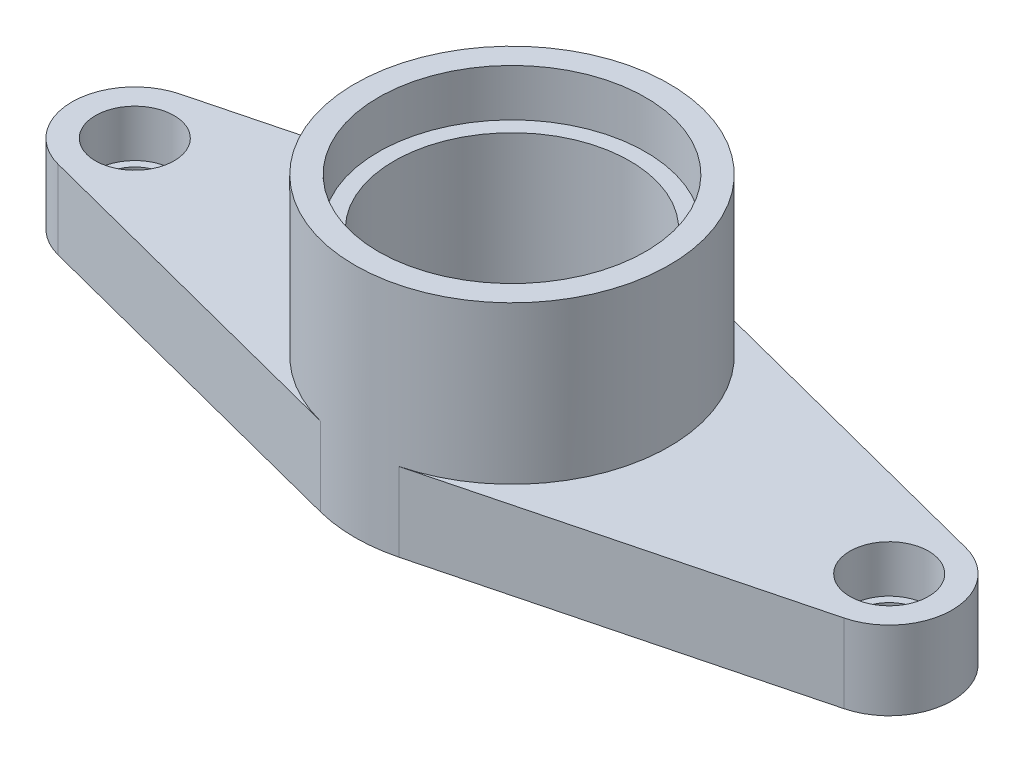
ISO-10303-21;
HEADER;
FILE_DESCRIPTION(('STEP AP214'),'2;1');
FILE_NAME('part.step','',(''),(''),'','','');
FILE_SCHEMA(('AUTOMOTIVE_DESIGN { 1 0 10303 214 1 1 1 1 }'));
ENDSEC;
DATA;
#1=APPLICATION_CONTEXT('core data for automotive mechanical design processes');
#2=APPLICATION_PROTOCOL_DEFINITION('international standard','automotive_design',2000,#1);
#3=PRODUCT_CONTEXT('',#1,'mechanical');
#4=PRODUCT('Part','Part','',(#3));
#5=PRODUCT_RELATED_PRODUCT_CATEGORY('part','',(#4));
#6=PRODUCT_DEFINITION_FORMATION('','',#4);
#7=PRODUCT_DEFINITION_CONTEXT('part definition',#1,'design');
#8=PRODUCT_DEFINITION('design','',#6,#7);
#9=PRODUCT_DEFINITION_SHAPE('','',#8);
#10=(LENGTH_UNIT() NAMED_UNIT(*) SI_UNIT(.MILLI.,.METRE.));
#11=(NAMED_UNIT(*) PLANE_ANGLE_UNIT() SI_UNIT($,.RADIAN.));
#12=(NAMED_UNIT(*) SI_UNIT($,.STERADIAN.) SOLID_ANGLE_UNIT());
#13=UNCERTAINTY_MEASURE_WITH_UNIT(LENGTH_MEASURE(1.E-05),#10,'distance_accuracy_value','');
#14=(GEOMETRIC_REPRESENTATION_CONTEXT(3) GLOBAL_UNCERTAINTY_ASSIGNED_CONTEXT((#13)) GLOBAL_UNIT_ASSIGNED_CONTEXT((#10,
#11,#12)) REPRESENTATION_CONTEXT('',''));
#15=CARTESIAN_POINT('',(0.,0.,0.));
#16=DIRECTION('',(0.,0.,1.));
#17=DIRECTION('',(1.,0.,0.));
#18=AXIS2_PLACEMENT_3D('',#15,#16,#17);
#19=CARTESIAN_POINT('',(-120.,25.,0.));
#20=DIRECTION('',(0.,1.,0.));
#21=DIRECTION('',(0.,0.,1.));
#22=AXIS2_PLACEMENT_3D('',#19,#20,#21);
#23=PLANE('',#22);
#24=CARTESIAN_POINT('',(-120.,25.,0.));
#25=DIRECTION('',(0.,1.,0.));
#26=DIRECTION('',(0.,0.,1.));
#27=AXIS2_PLACEMENT_3D('',#24,#25,#26);
#28=CIRCLE('',#27,12.5);
#29=CARTESIAN_POINT('',(-120.,25.,12.5));
#30=VERTEX_POINT('',#29);
#31=EDGE_CURVE('E158',#30,#30,#28,.T.);
#32=ORIENTED_EDGE('',*,*,#31,.F.);
#33=EDGE_LOOP('',(#32));
#34=FACE_BOUND('',#33,.T.);
#35=DIRECTION('',(0.968245836551854,0.,0.25));
#36=VECTOR('',#35,1.);
#37=CARTESIAN_POINT('',(-125.,25.,19.3649167310371));
#38=LINE('',#37,#36);
#39=CARTESIAN_POINT('',(-125.,25.,19.3649167310371));
#40=VERTEX_POINT('',#39);
#41=CARTESIAN_POINT('',(-12.5,25.,48.4122918275927));
#42=VERTEX_POINT('',#41);
#43=EDGE_CURVE('E99',#40,#42,#38,.T.);
#44=ORIENTED_EDGE('',*,*,#43,.T.);
#45=CARTESIAN_POINT('',(0.,25.,0.));
#46=DIRECTION('',(0.,1.,0.));
#47=DIRECTION('',(0.,0.,1.));
#48=AXIS2_PLACEMENT_3D('',#45,#46,#47);
#49=CIRCLE('',#48,50.);
#50=CARTESIAN_POINT('',(-12.5,25.,-48.4122918275927));
#51=VERTEX_POINT('',#50);
#52=EDGE_CURVE('E142',#42,#51,#49,.F.);
#53=ORIENTED_EDGE('',*,*,#52,.T.);
#54=DIRECTION('',(0.968245836551854,0.,-0.25));
#55=VECTOR('',#54,1.);
#56=CARTESIAN_POINT('',(-125.,25.,-19.3649167310371));
#57=LINE('',#56,#55);
#58=CARTESIAN_POINT('',(-125.,25.,-19.3649167310371));
#59=VERTEX_POINT('',#58);
#60=EDGE_CURVE('E124',#59,#51,#57,.T.);
#61=ORIENTED_EDGE('',*,*,#60,.F.);
#62=CARTESIAN_POINT('',(-120.,25.,0.));
#63=DIRECTION('',(0.,1.,0.));
#64=DIRECTION('',(0.,0.,1.));
#65=AXIS2_PLACEMENT_3D('',#62,#63,#64);
#66=CIRCLE('',#65,20.);
#67=EDGE_CURVE('E178',#59,#40,#66,.T.);
#68=ORIENTED_EDGE('',*,*,#67,.T.);
#69=EDGE_LOOP('',(#44,#53,#61,#68));
#70=FACE_BOUND('',#69,.T.);
#71=ADVANCED_FACE('F39',(#34,#70),#23,.T.);
#72=CARTESIAN_POINT('',(120.,25.,0.));
#73=DIRECTION('',(0.,1.,0.));
#74=DIRECTION('',(0.,0.,-1.));
#75=AXIS2_PLACEMENT_3D('',#72,#73,#74);
#76=CIRCLE('',#75,12.5);
#77=CARTESIAN_POINT('',(120.,25.,-12.5));
#78=VERTEX_POINT('',#77);
#79=EDGE_CURVE('E147',#78,#78,#76,.T.);
#80=ORIENTED_EDGE('',*,*,#79,.F.);
#81=EDGE_LOOP('',(#80));
#82=FACE_BOUND('',#81,.T.);
#83=DIRECTION('',(-0.968245836551854,0.,-0.25));
#84=VECTOR('',#83,1.);
#85=CARTESIAN_POINT('',(125.,25.,-19.3649167310371));
#86=LINE('',#85,#84);
#87=CARTESIAN_POINT('',(125.,25.,-19.3649167310371));
#88=VERTEX_POINT('',#87);
#89=CARTESIAN_POINT('',(12.5,25.,-48.4122918275927));
#90=VERTEX_POINT('',#89);
#91=EDGE_CURVE('E114',#88,#90,#86,.T.);
#92=ORIENTED_EDGE('',*,*,#91,.T.);
#93=CARTESIAN_POINT('',(12.5,25.,48.4122918275927));
#94=VERTEX_POINT('',#93);
#95=EDGE_CURVE('E119',#90,#94,#49,.F.);
#96=ORIENTED_EDGE('',*,*,#95,.T.);
#97=DIRECTION('',(-0.968245836551854,0.,0.25));
#98=VECTOR('',#97,1.);
#99=CARTESIAN_POINT('',(125.,25.,19.3649167310371));
#100=LINE('',#99,#98);
#101=CARTESIAN_POINT('',(125.,25.,19.3649167310371));
#102=VERTEX_POINT('',#101);
#103=EDGE_CURVE('E184',#102,#94,#100,.T.);
#104=ORIENTED_EDGE('',*,*,#103,.F.);
#105=CARTESIAN_POINT('',(120.,25.,0.));
#106=DIRECTION('',(0.,-1.,0.));
#107=DIRECTION('',(0.,0.,-1.));
#108=AXIS2_PLACEMENT_3D('',#105,#106,#107);
#109=CIRCLE('',#108,20.);
#110=EDGE_CURVE('E121',#88,#102,#109,.T.);
#111=ORIENTED_EDGE('',*,*,#110,.F.);
#112=EDGE_LOOP('',(#92,#96,#104,#111));
#113=FACE_BOUND('',#112,.T.);
#114=ADVANCED_FACE('F116',(#82,#113),#23,.T.);
#115=CARTESIAN_POINT('',(-120.,0.,0.));
#116=DIRECTION('',(0.,1.,0.));
#117=DIRECTION('',(0.,0.,1.));
#118=AXIS2_PLACEMENT_3D('',#115,#116,#117);
#119=CYLINDRICAL_SURFACE('',#118,9.99999999999999);
#120=CARTESIAN_POINT('',(-120.,0.,0.));
#121=DIRECTION('',(0.,1.,0.));
#122=DIRECTION('',(0.,0.,1.));
#123=AXIS2_PLACEMENT_3D('',#120,#121,#122);
#124=CIRCLE('',#123,9.99999999999999);
#125=CARTESIAN_POINT('',(-120.,0.,9.99999999999999));
#126=VERTEX_POINT('',#125);
#127=EDGE_CURVE('E169',#126,#126,#124,.T.);
#128=ORIENTED_EDGE('',*,*,#127,.F.);
#129=EDGE_LOOP('',(#128));
#130=FACE_BOUND('',#129,.T.);
#131=CARTESIAN_POINT('',(-120.,10.,0.));
#132=DIRECTION('',(0.,1.,0.));
#133=DIRECTION('',(0.,0.,1.));
#134=AXIS2_PLACEMENT_3D('',#131,#132,#133);
#135=CIRCLE('',#134,9.99999999999999);
#136=CARTESIAN_POINT('',(-120.,10.,9.99999999999999));
#137=VERTEX_POINT('',#136);
#138=EDGE_CURVE('E157',#137,#137,#135,.F.);
#139=ORIENTED_EDGE('',*,*,#138,.F.);
#140=EDGE_LOOP('',(#139));
#141=FACE_BOUND('',#140,.T.);
#142=ADVANCED_FACE('F262',(#130,#141),#119,.F.);
#143=CARTESIAN_POINT('',(-120.,25.,0.));
#144=DIRECTION('',(0.,-1.,0.));
#145=DIRECTION('',(0.,0.,-1.));
#146=AXIS2_PLACEMENT_3D('',#143,#144,#145);
#147=CYLINDRICAL_SURFACE('',#146,20.);
#148=CARTESIAN_POINT('',(-120.,0.,0.));
#149=DIRECTION('',(0.,1.,0.));
#150=DIRECTION('',(0.,0.,1.));
#151=AXIS2_PLACEMENT_3D('',#148,#149,#150);
#152=CIRCLE('',#151,20.);
#153=CARTESIAN_POINT('',(-125.,0.,-19.3649167310371));
#154=VERTEX_POINT('',#153);
#155=CARTESIAN_POINT('',(-125.,0.,19.3649167310371));
#156=VERTEX_POINT('',#155);
#157=EDGE_CURVE('E173',#154,#156,#152,.T.);
#158=ORIENTED_EDGE('',*,*,#157,.T.);
#159=DIRECTION('',(0.,-1.,0.));
#160=VECTOR('',#159,1.);
#161=CARTESIAN_POINT('',(-125.,25.,19.3649167310371));
#162=LINE('',#161,#160);
#163=EDGE_CURVE('E11',#40,#156,#162,.T.);
#164=ORIENTED_EDGE('',*,*,#163,.F.);
#165=ORIENTED_EDGE('',*,*,#67,.F.);
#166=DIRECTION('',(0.,-1.,0.));
#167=VECTOR('',#166,1.);
#168=CARTESIAN_POINT('',(-125.,25.,-19.3649167310371));
#169=LINE('',#168,#167);
#170=EDGE_CURVE('E59',#59,#154,#169,.T.);
#171=ORIENTED_EDGE('',*,*,#170,.T.);
#172=EDGE_LOOP('',(#158,#164,#165,#171));
#173=FACE_BOUND('',#172,.T.);
#174=ADVANCED_FACE('F41',(#173),#147,.T.);
#175=CARTESIAN_POINT('',(-125.,25.,19.3649167310371));
#176=DIRECTION('',(0.25,0.,-0.968245836551854));
#177=DIRECTION('',(-0.968245836551854,0.,-0.25));
#178=AXIS2_PLACEMENT_3D('',#175,#176,#177);
#179=PLANE('',#178);
#180=DIRECTION('',(0.968245836551854,0.,0.25));
#181=VECTOR('',#180,1.);
#182=CARTESIAN_POINT('',(-125.,0.,19.3649167310371));
#183=LINE('',#182,#181);
#184=CARTESIAN_POINT('',(-12.5,0.,48.4122918275927));
#185=VERTEX_POINT('',#184);
#186=EDGE_CURVE('E194',#156,#185,#183,.T.);
#187=ORIENTED_EDGE('',*,*,#186,.T.);
#188=DIRECTION('',(0.,-1.,0.));
#189=VECTOR('',#188,1.);
#190=CARTESIAN_POINT('',(-12.5,25.,48.4122918275927));
#191=LINE('',#190,#189);
#192=EDGE_CURVE('E50',#42,#185,#191,.T.);
#193=ORIENTED_EDGE('',*,*,#192,.F.);
#194=ORIENTED_EDGE('',*,*,#43,.F.);
#195=ORIENTED_EDGE('',*,*,#163,.T.);
#196=EDGE_LOOP('',(#187,#193,#194,#195));
#197=FACE_BOUND('',#196,.T.);
#198=ADVANCED_FACE('F286',(#197),#179,.F.);
#199=CARTESIAN_POINT('',(125.,25.,19.3649167310371));
#200=DIRECTION('',(0.25,0.,0.968245836551854));
#201=DIRECTION('',(0.968245836551854,0.,-0.25));
#202=AXIS2_PLACEMENT_3D('',#199,#200,#201);
#203=PLANE('',#202);
#204=DIRECTION('',(-0.968245836551854,0.,0.25));
#205=VECTOR('',#204,1.);
#206=CARTESIAN_POINT('',(125.,0.,19.3649167310371));
#207=LINE('',#206,#205);
#208=CARTESIAN_POINT('',(125.,0.,19.3649167310371));
#209=VERTEX_POINT('',#208);
#210=CARTESIAN_POINT('',(12.5,0.,48.4122918275927));
#211=VERTEX_POINT('',#210);
#212=EDGE_CURVE('E200',#209,#211,#207,.T.);
#213=ORIENTED_EDGE('',*,*,#212,.F.);
#214=DIRECTION('',(0.,-1.,0.));
#215=VECTOR('',#214,1.);
#216=CARTESIAN_POINT('',(125.,25.,19.3649167310371));
#217=LINE('',#216,#215);
#218=EDGE_CURVE('E222',#102,#209,#217,.T.);
#219=ORIENTED_EDGE('',*,*,#218,.F.);
#220=ORIENTED_EDGE('',*,*,#103,.T.);
#221=DIRECTION('',(0.,-1.,0.));
#222=VECTOR('',#221,1.);
#223=CARTESIAN_POINT('',(12.5,25.,48.4122918275927));
#224=LINE('',#223,#222);
#225=EDGE_CURVE('E140',#94,#211,#224,.T.);
#226=ORIENTED_EDGE('',*,*,#225,.T.);
#227=EDGE_LOOP('',(#213,#219,#220,#226));
#228=FACE_BOUND('',#227,.T.);
#229=ADVANCED_FACE('F283',(#228),#203,.T.);
#230=CARTESIAN_POINT('',(120.,25.,0.));
#231=DIRECTION('',(0.,-1.,0.));
#232=DIRECTION('',(0.,0.,-1.));
#233=AXIS2_PLACEMENT_3D('',#230,#231,#232);
#234=CYLINDRICAL_SURFACE('',#233,20.);
#235=CARTESIAN_POINT('',(120.,0.,0.));
#236=DIRECTION('',(0.,-1.,0.));
#237=DIRECTION('',(0.,0.,-1.));
#238=AXIS2_PLACEMENT_3D('',#235,#236,#237);
#239=CIRCLE('',#238,20.);
#240=CARTESIAN_POINT('',(125.,0.,-19.3649167310371));
#241=VERTEX_POINT('',#240);
#242=EDGE_CURVE('E204',#241,#209,#239,.T.);
#243=ORIENTED_EDGE('',*,*,#242,.F.);
#244=DIRECTION('',(0.,-1.,0.));
#245=VECTOR('',#244,1.);
#246=CARTESIAN_POINT('',(125.,25.,-19.3649167310371));
#247=LINE('',#246,#245);
#248=EDGE_CURVE('E134',#88,#241,#247,.T.);
#249=ORIENTED_EDGE('',*,*,#248,.F.);
#250=ORIENTED_EDGE('',*,*,#110,.T.);
#251=ORIENTED_EDGE('',*,*,#218,.T.);
#252=EDGE_LOOP('',(#243,#249,#250,#251));
#253=FACE_BOUND('',#252,.T.);
#254=ADVANCED_FACE('F280',(#253),#234,.T.);
#255=CARTESIAN_POINT('',(125.,25.,-19.3649167310371));
#256=DIRECTION('',(-0.25,0.,0.968245836551854));
#257=DIRECTION('',(0.968245836551854,0.,0.25));
#258=AXIS2_PLACEMENT_3D('',#255,#256,#257);
#259=PLANE('',#258);
#260=DIRECTION('',(-0.968245836551854,0.,-0.25));
#261=VECTOR('',#260,1.);
#262=CARTESIAN_POINT('',(125.,0.,-19.3649167310371));
#263=LINE('',#262,#261);
#264=CARTESIAN_POINT('',(12.5,0.,-48.4122918275927));
#265=VERTEX_POINT('',#264);
#266=EDGE_CURVE('E130',#241,#265,#263,.T.);
#267=ORIENTED_EDGE('',*,*,#266,.T.);
#268=DIRECTION('',(0.,-1.,0.));
#269=VECTOR('',#268,1.);
#270=CARTESIAN_POINT('',(12.5,25.,-48.4122918275927));
#271=LINE('',#270,#269);
#272=EDGE_CURVE('E127',#90,#265,#271,.T.);
#273=ORIENTED_EDGE('',*,*,#272,.F.);
#274=ORIENTED_EDGE('',*,*,#91,.F.);
#275=ORIENTED_EDGE('',*,*,#248,.T.);
#276=EDGE_LOOP('',(#267,#273,#274,#275));
#277=FACE_BOUND('',#276,.T.);
#278=ADVANCED_FACE('F128',(#277),#259,.F.);
#279=CARTESIAN_POINT('',(0.,25.,0.));
#280=DIRECTION('',(0.,-1.,0.));
#281=DIRECTION('',(0.,0.,-1.));
#282=AXIS2_PLACEMENT_3D('',#279,#280,#281);
#283=CYLINDRICAL_SURFACE('',#282,50.);
#284=CARTESIAN_POINT('',(0.,0.,0.));
#285=DIRECTION('',(0.,1.,0.));
#286=DIRECTION('',(0.,0.,1.));
#287=AXIS2_PLACEMENT_3D('',#284,#285,#286);
#288=CIRCLE('',#287,50.);
#289=CARTESIAN_POINT('',(-12.5,0.,-48.4122918275927));
#290=VERTEX_POINT('',#289);
#291=EDGE_CURVE('E210',#265,#290,#288,.T.);
#292=ORIENTED_EDGE('',*,*,#291,.T.);
#293=DIRECTION('',(0.,-1.,0.));
#294=VECTOR('',#293,1.);
#295=CARTESIAN_POINT('',(-12.5,25.,-48.4122918275927));
#296=LINE('',#295,#294);
#297=EDGE_CURVE('E87',#51,#290,#296,.T.);
#298=ORIENTED_EDGE('',*,*,#297,.F.);
#299=ORIENTED_EDGE('',*,*,#52,.F.);
#300=ORIENTED_EDGE('',*,*,#192,.T.);
#301=CARTESIAN_POINT('',(0.,0.,0.));
#302=DIRECTION('',(0.,1.,0.));
#303=DIRECTION('',(0.,0.,1.));
#304=AXIS2_PLACEMENT_3D('',#301,#302,#303);
#305=CIRCLE('',#304,50.);
#306=EDGE_CURVE('E197',#185,#211,#305,.T.);
#307=ORIENTED_EDGE('',*,*,#306,.T.);
#308=ORIENTED_EDGE('',*,*,#225,.F.);
#309=ORIENTED_EDGE('',*,*,#95,.F.);
#310=ORIENTED_EDGE('',*,*,#272,.T.);
#311=EDGE_LOOP('',(#292,#298,#299,#300,#307,#308,#309,#310));
#312=FACE_BOUND('',#311,.T.);
#313=CARTESIAN_POINT('',(0.,75.,0.));
#314=DIRECTION('',(0.,1.,0.));
#315=DIRECTION('',(0.,0.,1.));
#316=AXIS2_PLACEMENT_3D('',#313,#314,#315);
#317=CIRCLE('',#316,50.);
#318=CARTESIAN_POINT('',(0.,75.,50.));
#319=VERTEX_POINT('',#318);
#320=EDGE_CURVE('E143',#319,#319,#317,.T.);
#321=ORIENTED_EDGE('',*,*,#320,.F.);
#322=EDGE_LOOP('',(#321));
#323=FACE_BOUND('',#322,.T.);
#324=ADVANCED_FACE('F137',(#312,#323),#283,.T.);
#325=CARTESIAN_POINT('',(-125.,25.,-19.3649167310371));
#326=DIRECTION('',(-0.25,0.,-0.968245836551854));
#327=DIRECTION('',(-0.968245836551854,0.,0.25));
#328=AXIS2_PLACEMENT_3D('',#325,#326,#327);
#329=PLANE('',#328);
#330=DIRECTION('',(0.968245836551854,0.,-0.25));
#331=VECTOR('',#330,1.);
#332=CARTESIAN_POINT('',(-125.,0.,-19.3649167310371));
#333=LINE('',#332,#331);
#334=EDGE_CURVE('E181',#154,#290,#333,.T.);
#335=ORIENTED_EDGE('',*,*,#334,.F.);
#336=ORIENTED_EDGE('',*,*,#170,.F.);
#337=ORIENTED_EDGE('',*,*,#60,.T.);
#338=ORIENTED_EDGE('',*,*,#297,.T.);
#339=EDGE_LOOP('',(#335,#336,#337,#338));
#340=FACE_BOUND('',#339,.T.);
#341=ADVANCED_FACE('F272',(#340),#329,.T.);
#342=CARTESIAN_POINT('',(-120.,0.,0.));
#343=DIRECTION('',(0.,1.,0.));
#344=DIRECTION('',(0.,0.,1.));
#345=AXIS2_PLACEMENT_3D('',#342,#343,#344);
#346=PLANE('',#345);
#347=CARTESIAN_POINT('',(0.,0.,0.));
#348=DIRECTION('',(0.,1.,0.));
#349=DIRECTION('',(0.,0.,1.));
#350=AXIS2_PLACEMENT_3D('',#347,#348,#349);
#351=CIRCLE('',#350,37.5);
#352=CARTESIAN_POINT('',(0.,0.,37.5));
#353=VERTEX_POINT('',#352);
#354=EDGE_CURVE('E436',#353,#353,#351,.T.);
#355=ORIENTED_EDGE('',*,*,#354,.T.);
#356=EDGE_LOOP('',(#355));
#357=FACE_BOUND('',#356,.T.);
#358=ORIENTED_EDGE('',*,*,#306,.F.);
#359=ORIENTED_EDGE('',*,*,#186,.F.);
#360=ORIENTED_EDGE('',*,*,#157,.F.);
#361=ORIENTED_EDGE('',*,*,#334,.T.);
#362=ORIENTED_EDGE('',*,*,#291,.F.);
#363=ORIENTED_EDGE('',*,*,#266,.F.);
#364=ORIENTED_EDGE('',*,*,#242,.T.);
#365=ORIENTED_EDGE('',*,*,#212,.T.);
#366=EDGE_LOOP('',(#358,#359,#360,#361,#362,#363,#364,#365));
#367=FACE_BOUND('',#366,.T.);
#368=CARTESIAN_POINT('',(120.,0.,0.));
#369=DIRECTION('',(0.,1.,0.));
#370=DIRECTION('',(0.,0.,-1.));
#371=AXIS2_PLACEMENT_3D('',#368,#369,#370);
#372=CIRCLE('',#371,9.99999999999999);
#373=CARTESIAN_POINT('',(120.,0.,-9.99999999999999));
#374=VERTEX_POINT('',#373);
#375=EDGE_CURVE('E174',#374,#374,#372,.T.);
#376=ORIENTED_EDGE('',*,*,#375,.T.);
#377=EDGE_LOOP('',(#376));
#378=FACE_BOUND('',#377,.T.);
#379=ORIENTED_EDGE('',*,*,#127,.T.);
#380=EDGE_LOOP('',(#379));
#381=FACE_BOUND('',#380,.T.);
#382=ADVANCED_FACE('F269',(#357,#367,#378,#381),#346,.F.);
#383=CARTESIAN_POINT('',(120.,0.,0.));
#384=DIRECTION('',(0.,1.,0.));
#385=DIRECTION('',(0.,0.,1.));
#386=AXIS2_PLACEMENT_3D('',#383,#384,#385);
#387=CYLINDRICAL_SURFACE('',#386,9.99999999999999);
#388=CARTESIAN_POINT('',(120.,10.,0.));
#389=DIRECTION('',(0.,-1.,0.));
#390=DIRECTION('',(0.,0.,-1.));
#391=AXIS2_PLACEMENT_3D('',#388,#389,#390);
#392=CIRCLE('',#391,9.99999999999999);
#393=CARTESIAN_POINT('',(120.,10.,-9.99999999999999));
#394=VERTEX_POINT('',#393);
#395=EDGE_CURVE('E43',#394,#394,#392,.F.);
#396=ORIENTED_EDGE('',*,*,#395,.T.);
#397=EDGE_LOOP('',(#396));
#398=FACE_BOUND('',#397,.T.);
#399=ORIENTED_EDGE('',*,*,#375,.F.);
#400=EDGE_LOOP('',(#399));
#401=FACE_BOUND('',#400,.T.);
#402=ADVANCED_FACE('F237',(#398,#401),#387,.F.);
#403=CARTESIAN_POINT('',(-120.,10.,0.));
#404=DIRECTION('',(0.,1.,0.));
#405=DIRECTION('',(0.,0.,1.));
#406=AXIS2_PLACEMENT_3D('',#403,#404,#405);
#407=PLANE('',#406);
#408=CARTESIAN_POINT('',(-120.,10.,0.));
#409=DIRECTION('',(0.,1.,0.));
#410=DIRECTION('',(0.,0.,1.));
#411=AXIS2_PLACEMENT_3D('',#408,#409,#410);
#412=CIRCLE('',#411,12.5);
#413=CARTESIAN_POINT('',(-120.,10.,12.5));
#414=VERTEX_POINT('',#413);
#415=EDGE_CURVE('E153',#414,#414,#412,.T.);
#416=ORIENTED_EDGE('',*,*,#415,.T.);
#417=EDGE_LOOP('',(#416));
#418=FACE_BOUND('',#417,.T.);
#419=ORIENTED_EDGE('',*,*,#138,.T.);
#420=EDGE_LOOP('',(#419));
#421=FACE_BOUND('',#420,.T.);
#422=ADVANCED_FACE('F253',(#418,#421),#407,.T.);
#423=CARTESIAN_POINT('',(-120.,10.,0.));
#424=DIRECTION('',(0.,1.,0.));
#425=DIRECTION('',(0.,0.,1.));
#426=AXIS2_PLACEMENT_3D('',#423,#424,#425);
#427=CYLINDRICAL_SURFACE('',#426,12.5);
#428=ORIENTED_EDGE('',*,*,#415,.F.);
#429=EDGE_LOOP('',(#428));
#430=FACE_BOUND('',#429,.T.);
#431=ORIENTED_EDGE('',*,*,#31,.T.);
#432=EDGE_LOOP('',(#431));
#433=FACE_BOUND('',#432,.T.);
#434=ADVANCED_FACE('F243',(#430,#433),#427,.F.);
#435=CARTESIAN_POINT('',(120.,10.,0.));
#436=DIRECTION('',(0.,-1.,0.));
#437=DIRECTION('',(0.,0.,-1.));
#438=AXIS2_PLACEMENT_3D('',#435,#436,#437);
#439=PLANE('',#438);
#440=CARTESIAN_POINT('',(120.,10.,0.));
#441=DIRECTION('',(0.,1.,0.));
#442=DIRECTION('',(0.,0.,-1.));
#443=AXIS2_PLACEMENT_3D('',#440,#441,#442);
#444=CIRCLE('',#443,12.5);
#445=CARTESIAN_POINT('',(120.,10.,-12.5));
#446=VERTEX_POINT('',#445);
#447=EDGE_CURVE('E162',#446,#446,#444,.T.);
#448=ORIENTED_EDGE('',*,*,#447,.T.);
#449=EDGE_LOOP('',(#448));
#450=FACE_BOUND('',#449,.T.);
#451=ORIENTED_EDGE('',*,*,#395,.F.);
#452=EDGE_LOOP('',(#451));
#453=FACE_BOUND('',#452,.T.);
#454=ADVANCED_FACE('F240',(#450,#453),#439,.F.);
#455=CARTESIAN_POINT('',(120.,10.,0.));
#456=DIRECTION('',(0.,1.,0.));
#457=DIRECTION('',(0.,0.,1.));
#458=AXIS2_PLACEMENT_3D('',#455,#456,#457);
#459=CYLINDRICAL_SURFACE('',#458,12.5);
#460=ORIENTED_EDGE('',*,*,#447,.F.);
#461=EDGE_LOOP('',(#460));
#462=FACE_BOUND('',#461,.T.);
#463=ORIENTED_EDGE('',*,*,#79,.T.);
#464=EDGE_LOOP('',(#463));
#465=FACE_BOUND('',#464,.T.);
#466=ADVANCED_FACE('F242',(#462,#465),#459,.F.);
#467=CARTESIAN_POINT('',(0.,75.,0.));
#468=DIRECTION('',(0.,1.,0.));
#469=DIRECTION('',(0.,0.,1.));
#470=AXIS2_PLACEMENT_3D('',#467,#468,#469);
#471=PLANE('',#470);
#472=CARTESIAN_POINT('',(0.,75.,0.));
#473=DIRECTION('',(0.,1.,0.));
#474=DIRECTION('',(0.,0.,1.));
#475=AXIS2_PLACEMENT_3D('',#472,#473,#474);
#476=CIRCLE('',#475,42.5);
#477=CARTESIAN_POINT('',(0.,75.,42.5));
#478=VERTEX_POINT('',#477);
#479=EDGE_CURVE('E443',#478,#478,#476,.T.);
#480=ORIENTED_EDGE('',*,*,#479,.F.);
#481=EDGE_LOOP('',(#480));
#482=FACE_BOUND('',#481,.T.);
#483=ORIENTED_EDGE('',*,*,#320,.T.);
#484=EDGE_LOOP('',(#483));
#485=FACE_BOUND('',#484,.T.);
#486=ADVANCED_FACE('F250',(#482,#485),#471,.T.);
#487=CARTESIAN_POINT('',(0.,60.,0.));
#488=DIRECTION('',(0.,1.,0.));
#489=DIRECTION('',(0.,0.,1.));
#490=AXIS2_PLACEMENT_3D('',#487,#488,#489);
#491=CYLINDRICAL_SURFACE('',#490,42.5);
#492=CARTESIAN_POINT('',(0.,60.,0.));
#493=DIRECTION('',(0.,1.,0.));
#494=DIRECTION('',(0.,0.,1.));
#495=AXIS2_PLACEMENT_3D('',#492,#493,#494);
#496=CIRCLE('',#495,42.5);
#497=CARTESIAN_POINT('',(0.,60.,42.5));
#498=VERTEX_POINT('',#497);
#499=EDGE_CURVE('E149',#498,#498,#496,.T.);
#500=ORIENTED_EDGE('',*,*,#499,.F.);
#501=EDGE_LOOP('',(#500));
#502=FACE_BOUND('',#501,.T.);
#503=ORIENTED_EDGE('',*,*,#479,.T.);
#504=EDGE_LOOP('',(#503));
#505=FACE_BOUND('',#504,.T.);
#506=ADVANCED_FACE('F402',(#502,#505),#491,.F.);
#507=CARTESIAN_POINT('',(0.,60.,0.));
#508=DIRECTION('',(0.,1.,0.));
#509=DIRECTION('',(0.,0.,1.));
#510=AXIS2_PLACEMENT_3D('',#507,#508,#509);
#511=PLANE('',#510);
#512=CARTESIAN_POINT('',(0.,60.,0.));
#513=DIRECTION('',(0.,1.,0.));
#514=DIRECTION('',(0.,0.,1.));
#515=AXIS2_PLACEMENT_3D('',#512,#513,#514);
#516=CIRCLE('',#515,37.5);
#517=CARTESIAN_POINT('',(0.,60.,37.5));
#518=VERTEX_POINT('',#517);
#519=EDGE_CURVE('E439',#518,#518,#516,.T.);
#520=ORIENTED_EDGE('',*,*,#519,.F.);
#521=EDGE_LOOP('',(#520));
#522=FACE_BOUND('',#521,.T.);
#523=ORIENTED_EDGE('',*,*,#499,.T.);
#524=EDGE_LOOP('',(#523));
#525=FACE_BOUND('',#524,.T.);
#526=ADVANCED_FACE('F410',(#522,#525),#511,.T.);
#527=CARTESIAN_POINT('',(0.,0.,0.));
#528=DIRECTION('',(0.,1.,0.));
#529=DIRECTION('',(0.,0.,1.));
#530=AXIS2_PLACEMENT_3D('',#527,#528,#529);
#531=CYLINDRICAL_SURFACE('',#530,37.5);
#532=ORIENTED_EDGE('',*,*,#354,.F.);
#533=EDGE_LOOP('',(#532));
#534=FACE_BOUND('',#533,.T.);
#535=ORIENTED_EDGE('',*,*,#519,.T.);
#536=EDGE_LOOP('',(#535));
#537=FACE_BOUND('',#536,.T.);
#538=ADVANCED_FACE('F418',(#534,#537),#531,.F.);
#539=CLOSED_SHELL('',(#71,#114,#142,#174,#198,#229,#254,#278,#324,#341,#382,#402,#422,#434,#454,
#466,#486,#506,#526,#538));
#540=MANIFOLD_SOLID_BREP('B2',#539);
#541=ADVANCED_BREP_SHAPE_REPRESENTATION('',(#18,#540),#14);
#542=SHAPE_DEFINITION_REPRESENTATION(#9,#541);
ENDSEC;
END-ISO-10303-21;
